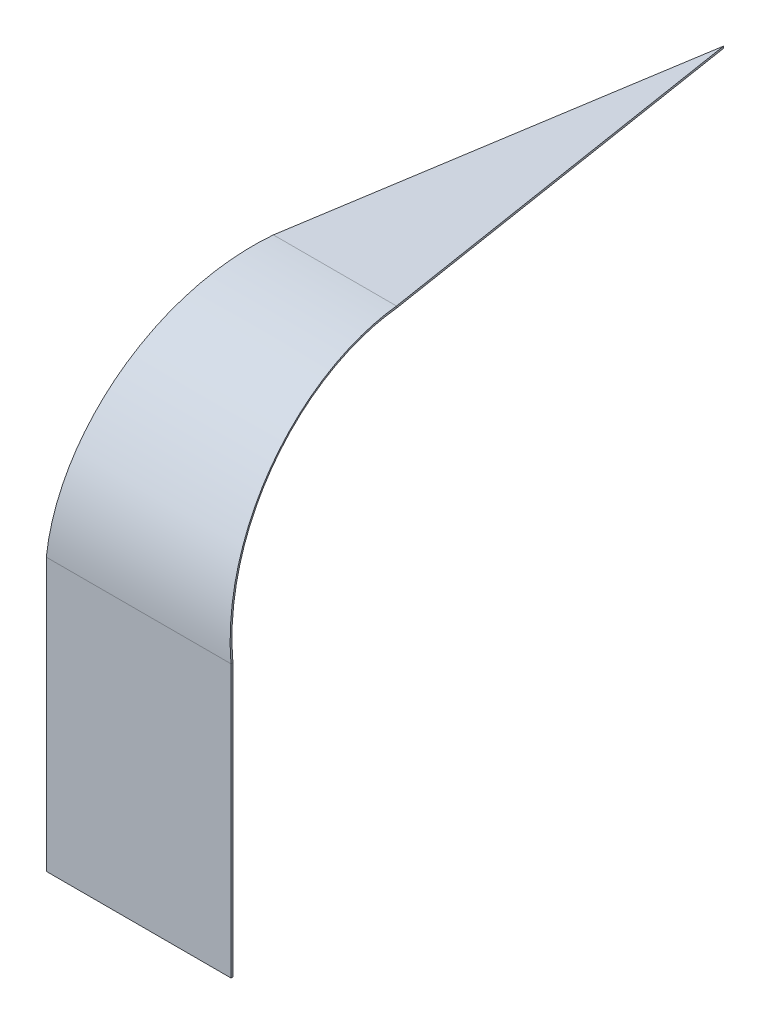
ISO-10303-21;
HEADER;
FILE_DESCRIPTION(('STEP AP214'),'2;1');
FILE_NAME('part.step','',(''),(''),'','','');
FILE_SCHEMA(('AUTOMOTIVE_DESIGN { 1 0 10303 214 1 1 1 1 }'));
ENDSEC;
DATA;
#1=APPLICATION_CONTEXT('core data for automotive mechanical design processes');
#2=APPLICATION_PROTOCOL_DEFINITION('international standard','automotive_design',2000,#1);
#3=PRODUCT_CONTEXT('',#1,'mechanical');
#4=PRODUCT('Part','Part','',(#3));
#5=PRODUCT_RELATED_PRODUCT_CATEGORY('part','',(#4));
#6=PRODUCT_DEFINITION_FORMATION('','',#4);
#7=PRODUCT_DEFINITION_CONTEXT('part definition',#1,'design');
#8=PRODUCT_DEFINITION('design','',#6,#7);
#9=PRODUCT_DEFINITION_SHAPE('','',#8);
#10=(LENGTH_UNIT() NAMED_UNIT(*) SI_UNIT(.MILLI.,.METRE.));
#11=(NAMED_UNIT(*) PLANE_ANGLE_UNIT() SI_UNIT($,.RADIAN.));
#12=(NAMED_UNIT(*) SI_UNIT($,.STERADIAN.) SOLID_ANGLE_UNIT());
#13=UNCERTAINTY_MEASURE_WITH_UNIT(LENGTH_MEASURE(1.E-05),#10,'distance_accuracy_value','');
#14=(GEOMETRIC_REPRESENTATION_CONTEXT(3) GLOBAL_UNCERTAINTY_ASSIGNED_CONTEXT((#13)) GLOBAL_UNIT_ASSIGNED_CONTEXT((#10,
#11,#12)) REPRESENTATION_CONTEXT('',''));
#15=CARTESIAN_POINT('',(0.,0.,0.));
#16=DIRECTION('',(0.,0.,1.));
#17=DIRECTION('',(1.,0.,0.));
#18=AXIS2_PLACEMENT_3D('',#15,#16,#17);
#19=CARTESIAN_POINT('',(0.,-1.,0.));
#20=DIRECTION('',(0.987688340595139,0.,-0.156434465040231));
#21=DIRECTION('',(-0.156434465040231,0.,-0.987688340595138));
#22=AXIS2_PLACEMENT_3D('',#19,#20,#21);
#23=PLANE('',#22);
#24=DIRECTION('',(-0.156434465040231,0.,-0.987688340595138));
#25=VECTOR('',#24,1.);
#26=CARTESIAN_POINT('',(0.,0.,0.));
#27=LINE('',#26,#25);
#28=CARTESIAN_POINT('',(31.6768880649073,0.,200.));
#29=VERTEX_POINT('',#28);
#30=CARTESIAN_POINT('',(0.,0.,0.));
#31=VERTEX_POINT('',#30);
#32=EDGE_CURVE('E287',#29,#31,#27,.T.);
#33=ORIENTED_EDGE('',*,*,#32,.F.);
#34=CARTESIAN_POINT('',(31.6768880649073,-1.,200.));
#35=CARTESIAN_POINT('',(31.6768880649073,-0.916666666666677,200.));
#36=CARTESIAN_POINT('',(31.6768880649073,-0.750000000000001,200.));
#37=CARTESIAN_POINT('',(31.6768880649073,-0.5,200.));
#38=CARTESIAN_POINT('',(31.6768880649073,-0.25,200.));
#39=CARTESIAN_POINT('',(31.6768880649073,-0.0833333333333242,200.));
#40=CARTESIAN_POINT('',(31.6768880649073,0.,200.));
#41=B_SPLINE_CURVE_WITH_KNOTS('',3,(#34,#35,#36,#37,#38,#39,#40),.UNSPECIFIED.,.F.,.F.,(4,1,1,1,
4),(0.5,0.501622235647171,0.503244471294342,0.504866706941513,0.506488942588684),.UNSPECIFIED.);
#42=CARTESIAN_POINT('',(31.6768880649073,-1.,200.));
#43=VERTEX_POINT('',#42);
#44=EDGE_CURVE('E13',#43,#29,#41,.T.);
#45=ORIENTED_EDGE('',*,*,#44,.F.);
#46=DIRECTION('',(-0.156434465040231,0.,-0.987688340595138));
#47=VECTOR('',#46,1.);
#48=CARTESIAN_POINT('',(0.,-1.,0.));
#49=LINE('',#48,#47);
#50=CARTESIAN_POINT('',(0.,-1.,0.));
#51=VERTEX_POINT('',#50);
#52=EDGE_CURVE('E173',#43,#51,#49,.T.);
#53=ORIENTED_EDGE('',*,*,#52,.T.);
#54=DIRECTION('',(0.,1.,0.));
#55=VECTOR('',#54,1.);
#56=CARTESIAN_POINT('',(0.,-1.,0.));
#57=LINE('',#56,#55);
#58=EDGE_CURVE('E142',#51,#31,#57,.T.);
#59=ORIENTED_EDGE('',*,*,#58,.T.);
#60=EDGE_LOOP('',(#33,#45,#53,#59));
#61=FACE_BOUND('',#60,.T.);
#62=ADVANCED_FACE('F114',(#61),#23,.T.);
#63=CARTESIAN_POINT('',(0.,-1.,0.));
#64=DIRECTION('',(-0.987688340595139,0.,-0.156434465040231));
#65=DIRECTION('',(-0.156434465040231,0.,0.987688340595138));
#66=AXIS2_PLACEMENT_3D('',#63,#64,#65);
#67=PLANE('',#66);
#68=DIRECTION('',(-0.156434465040231,0.,0.987688340595138));
#69=VECTOR('',#68,1.);
#70=CARTESIAN_POINT('',(0.,0.,0.));
#71=LINE('',#70,#69);
#72=CARTESIAN_POINT('',(-31.6768880649074,0.,200.));
#73=VERTEX_POINT('',#72);
#74=EDGE_CURVE('E167',#31,#73,#71,.T.);
#75=ORIENTED_EDGE('',*,*,#74,.F.);
#76=ORIENTED_EDGE('',*,*,#58,.F.);
#77=DIRECTION('',(-0.156434465040231,0.,0.987688340595138));
#78=VECTOR('',#77,1.);
#79=CARTESIAN_POINT('',(0.,-1.,0.));
#80=LINE('',#79,#78);
#81=CARTESIAN_POINT('',(-31.6768880649074,-1.,200.));
#82=VERTEX_POINT('',#81);
#83=EDGE_CURVE('E164',#51,#82,#80,.T.);
#84=ORIENTED_EDGE('',*,*,#83,.T.);
#85=CARTESIAN_POINT('',(-31.6768880649074,0.,200.));
#86=CARTESIAN_POINT('',(-31.6768880649074,-0.0833333333333242,200.));
#87=CARTESIAN_POINT('',(-31.6768880649074,-0.25,200.));
#88=CARTESIAN_POINT('',(-31.6768880649074,-0.5,200.));
#89=CARTESIAN_POINT('',(-31.6768880649073,-0.750000000000001,200.));
#90=CARTESIAN_POINT('',(-31.6768880649074,-0.916666666666677,200.));
#91=CARTESIAN_POINT('',(-31.6768880649074,-1.,200.));
#92=B_SPLINE_CURVE_WITH_KNOTS('',3,(#85,#86,#87,#88,#89,#90,#91),.UNSPECIFIED.,.F.,.F.,(4,1,1,1,
4),(0.,0.00162223564717101,0.00324447129434205,0.00486670694151303,0.00648894258868404),.UNSPECIFIED.);
#93=EDGE_CURVE('E125',#82,#73,#92,.F.);
#94=ORIENTED_EDGE('',*,*,#93,.T.);
#95=EDGE_LOOP('',(#75,#76,#84,#94));
#96=FACE_BOUND('',#95,.T.);
#97=ADVANCED_FACE('F163',(#96),#67,.T.);
#98=CARTESIAN_POINT('',(31.6768880649073,-1.,200.));
#99=DIRECTION('',(0.,1.,0.));
#100=DIRECTION('',(0.,0.,1.));
#101=AXIS2_PLACEMENT_3D('',#98,#99,#100);
#102=PLANE('',#101);
#103=ORIENTED_EDGE('',*,*,#52,.F.);
#104=CARTESIAN_POINT('',(-31.6768880649074,-1.,200.));
#105=CARTESIAN_POINT('',(-29.0235880245352,-1.,200.));
#106=CARTESIAN_POINT('',(-23.7306679637548,-1.,200.));
#107=CARTESIAN_POINT('',(-15.8165640692455,-1.,200.));
#108=CARTESIAN_POINT('',(-7.91248559223973,-1.,200.));
#109=CARTESIAN_POINT('',(-2.63974067207556,-1.,200.));
#110=CARTESIAN_POINT('',(2.63974067207562,-1.,200.));
#111=CARTESIAN_POINT('',(7.91248559223973,-1.,200.000000000001));
#112=CARTESIAN_POINT('',(15.8165640692454,-1.,200.));
#113=CARTESIAN_POINT('',(23.7306679637548,-1.,200.));
#114=CARTESIAN_POINT('',(29.0235880245351,-1.,200.));
#115=CARTESIAN_POINT('',(31.6768880649073,-1.,200.));
#116=B_SPLINE_CURVE_WITH_KNOTS('',3,(#104,#105,#106,#107,#108,#109,#110,#111,#112,#113,#114,
#115),.UNSPECIFIED.,.F.,.F.,(4,1,1,1,2,1,1,1,4),(0.506488942588684,0.568177824765099,
0.629866706941513,0.691555589117927,0.753244471294342,0.814933353470756,0.876622235647171,
0.938311117823586,1.),.UNSPECIFIED.);
#117=EDGE_CURVE('E169',#82,#43,#116,.T.);
#118=ORIENTED_EDGE('',*,*,#117,.F.);
#119=ORIENTED_EDGE('',*,*,#83,.F.);
#120=EDGE_LOOP('',(#103,#118,#119));
#121=FACE_BOUND('',#120,.T.);
#122=ADVANCED_FACE('F172',(#121),#102,.F.);
#123=CARTESIAN_POINT('',(31.6768880649073,0.,200.));
#124=DIRECTION('',(0.,1.,0.));
#125=DIRECTION('',(0.,0.,1.));
#126=AXIS2_PLACEMENT_3D('',#123,#124,#125);
#127=PLANE('',#126);
#128=ORIENTED_EDGE('',*,*,#32,.T.);
#129=ORIENTED_EDGE('',*,*,#74,.T.);
#130=CARTESIAN_POINT('',(31.6768880649073,0.,200.));
#131=CARTESIAN_POINT('',(26.3974067207561,0.,200.));
#132=CARTESIAN_POINT('',(15.8384440324536,0.,200.));
#133=CARTESIAN_POINT('',(-1.11022302462516E-13,0.,200.));
#134=CARTESIAN_POINT('',(-15.8384440324537,0.,200.));
#135=CARTESIAN_POINT('',(-26.3974067207561,0.,200.));
#136=CARTESIAN_POINT('',(-31.6768880649074,0.,200.));
#137=B_SPLINE_CURVE_WITH_KNOTS('',3,(#130,#131,#132,#133,#134,#135,#136),.UNSPECIFIED.,.F.,.F.,
(4,1,1,1,4),(0.00648894258868404,0.129866706941513,0.253244471294342,0.376622235647171,0.5),.UNSPECIFIED.);
#138=EDGE_CURVE('E178',#73,#29,#137,.F.);
#139=ORIENTED_EDGE('',*,*,#138,.T.);
#140=EDGE_LOOP('',(#128,#129,#139));
#141=FACE_BOUND('',#140,.T.);
#142=ADVANCED_FACE('F199',(#141),#127,.T.);
#143=CARTESIAN_POINT('',(47.5,-101.,300.));
#144=CARTESIAN_POINT('',(46.6209382258282,-92.1597005333333,300.));
#145=CARTESIAN_POINT('',(44.8628146774845,-74.7134879842578,297.652066259216));
#146=CARTESIAN_POINT('',(42.225629354969,-50.5506001395895,287.660743524164));
#147=CARTESIAN_POINT('',(39.5884440324537,-29.4615186681614,271.538481331839));
#148=CARTESIAN_POINT('',(36.9512587099382,-13.3392564758364,250.449399860411));
#149=CARTESIAN_POINT('',(34.3140733874228,-3.34793374078451,226.286512015742));
#150=CARTESIAN_POINT('',(32.5559498390791,-1.,208.840299466667));
#151=CARTESIAN_POINT('',(31.6768880649073,-1.,200.));
#152=CARTESIAN_POINT('',(43.5618939079376,-101.,300.));
#153=CARTESIAN_POINT('',(42.7542102477486,-92.1597005333333,300.));
#154=CARTESIAN_POINT('',(41.1388429273705,-74.7134879842578,297.652066259216));
#155=CARTESIAN_POINT('',(38.7157919468035,-50.5506001395895,287.660743524164));
#156=CARTESIAN_POINT('',(36.2927409662364,-29.4615186681614,271.538481331839));
#157=CARTESIAN_POINT('',(33.8696899856692,-13.3392564758364,250.449399860411));
#158=CARTESIAN_POINT('',(31.4466390051021,-3.34793374078451,226.286512015742));
#159=CARTESIAN_POINT('',(29.831271684724,-1.,208.840299466667));
#160=CARTESIAN_POINT('',(29.0235880245351,-1.,200.));
#161=CARTESIAN_POINT('',(35.6656340259621,-101.,300.));
#162=CARTESIAN_POINT('',(35.0025803558396,-92.1597005333334,300.));
#163=CARTESIAN_POINT('',(33.6764730155943,-74.7134879842578,297.652066259216));
#164=CARTESIAN_POINT('',(31.6873120052264,-50.5506001395896,287.660743524164));
#165=CARTESIAN_POINT('',(29.6981509948585,-29.4615186681614,271.538481331839));
#166=CARTESIAN_POINT('',(27.7089899844906,-13.3392564758364,250.449399860411));
#167=CARTESIAN_POINT('',(25.7198289741227,-3.34793374078454,226.286512015743));
#168=CARTESIAN_POINT('',(24.3937216338774,-1.,208.840299466667));
#169=CARTESIAN_POINT('',(23.7306679637548,-1.,200.));
#170=CARTESIAN_POINT('',(23.7831011692025,-101.,300.));
#171=CARTESIAN_POINT('',(23.3405157747603,-92.1597005333333,300.));
#172=CARTESIAN_POINT('',(22.4553449858763,-74.7134879842577,297.652066259216));
#173=CARTESIAN_POINT('',(21.1275888025502,-50.5506001395895,287.660743524164));
#174=CARTESIAN_POINT('',(19.799832619224,-29.4615186681613,271.538481331839));
#175=CARTESIAN_POINT('',(18.4720764358977,-13.3392564758363,250.44939986041));
#176=CARTESIAN_POINT('',(17.1443202525717,-3.34793374078451,226.286512015742));
#177=CARTESIAN_POINT('',(16.2591494636876,-1.,208.840299466666));
#178=CARTESIAN_POINT('',(15.8165640692454,-1.,200.));
#179=CARTESIAN_POINT('',(11.8851785824544,-101.,300.));
#180=CARTESIAN_POINT('',(11.6644734163314,-92.1597005333334,300.));
#181=CARTESIAN_POINT('',(11.2230630840852,-74.7134879842578,297.652066259216));
#182=CARTESIAN_POINT('',(10.5609475857161,-50.5506001395896,287.660743524164));
#183=CARTESIAN_POINT('',(9.89883208734699,-29.4615186681614,271.538481331839));
#184=CARTESIAN_POINT('',(9.2367165889779,-13.3392564758364,250.449399860411));
#185=CARTESIAN_POINT('',(8.57460109060876,-3.34793374078454,226.286512015743));
#186=CARTESIAN_POINT('',(8.13319075836277,-1.,208.840299466667));
#187=CARTESIAN_POINT('',(7.91248559223973,-1.,200.000000000001));
#188=CARTESIAN_POINT('',(3.95833333333329,-101.,300.));
#189=CARTESIAN_POINT('',(3.88507818548561,-92.1597005333333,300.));
#190=CARTESIAN_POINT('',(3.73856788979043,-74.7134879842578,297.652066259216));
#191=CARTESIAN_POINT('',(3.51880244624742,-50.5506001395895,287.660743524164));
#192=CARTESIAN_POINT('',(3.29903700270445,-29.4615186681614,271.538481331839));
#193=CARTESIAN_POINT('',(3.07927155916149,-13.3392564758364,250.449399860411));
#194=CARTESIAN_POINT('',(2.85950611561858,-3.34793374078451,226.286512015742));
#195=CARTESIAN_POINT('',(2.71299581992318,-1.,208.840299466667));
#196=CARTESIAN_POINT('',(2.63974067207562,-1.,200.));
#197=CARTESIAN_POINT('',(-3.95833333333334,-101.,300.));
#198=CARTESIAN_POINT('',(-3.88507818548567,-92.1597005333333,300.));
#199=CARTESIAN_POINT('',(-3.73856788979032,-74.7134879842578,297.652066259216));
#200=CARTESIAN_POINT('',(-3.51880244624747,-50.5506001395895,287.660743524164));
#201=CARTESIAN_POINT('',(-3.29903700270445,-29.4615186681614,271.538481331839));
#202=CARTESIAN_POINT('',(-3.0792715591616,-13.3392564758364,250.449399860411));
#203=CARTESIAN_POINT('',(-2.85950611561853,-3.34793374078451,226.286512015742));
#204=CARTESIAN_POINT('',(-2.71299581992324,-1.,208.840299466667));
#205=CARTESIAN_POINT('',(-2.63974067207556,-1.,200.));
#206=CARTESIAN_POINT('',(-11.8851785824544,-101.,300.));
#207=CARTESIAN_POINT('',(-11.6644734163314,-92.1597005333333,300.));
#208=CARTESIAN_POINT('',(-11.2230630840853,-74.7134879842578,297.652066259215));
#209=CARTESIAN_POINT('',(-10.5609475857162,-50.5506001395895,287.660743524164));
#210=CARTESIAN_POINT('',(-9.89883208734704,-29.4615186681614,271.538481331839));
#211=CARTESIAN_POINT('',(-9.23671658897796,-13.3392564758364,250.44939986041));
#212=CARTESIAN_POINT('',(-8.57460109060887,-3.34793374078451,226.286512015742));
#213=CARTESIAN_POINT('',(-8.13319075836277,-1.,208.840299466667));
#214=CARTESIAN_POINT('',(-7.91248559223973,-1.,200.));
#215=CARTESIAN_POINT('',(-23.7831011692026,-101.,300.000000000001));
#216=CARTESIAN_POINT('',(-23.3405157747604,-92.1597005333333,300.000000000001));
#217=CARTESIAN_POINT('',(-22.4553449858764,-74.7134879842578,297.652066259216));
#218=CARTESIAN_POINT('',(-21.1275888025502,-50.5506001395895,287.660743524164));
#219=CARTESIAN_POINT('',(-19.7998326192241,-29.4615186681614,271.538481331839));
#220=CARTESIAN_POINT('',(-18.4720764358979,-13.3392564758364,250.449399860411));
#221=CARTESIAN_POINT('',(-17.1443202525717,-3.34793374078451,226.286512015742));
#222=CARTESIAN_POINT('',(-16.2591494636875,-1.,208.840299466667));
#223=CARTESIAN_POINT('',(-15.8165640692455,-1.,200.));
#224=CARTESIAN_POINT('',(-35.6656340259623,-101.,300.));
#225=CARTESIAN_POINT('',(-35.0025803558395,-92.1597005333333,300.));
#226=CARTESIAN_POINT('',(-33.6764730155943,-74.7134879842578,297.652066259215));
#227=CARTESIAN_POINT('',(-31.6873120052265,-50.5506001395895,287.660743524163));
#228=CARTESIAN_POINT('',(-29.6981509948584,-29.4615186681614,271.538481331839));
#229=CARTESIAN_POINT('',(-27.7089899844906,-13.3392564758364,250.44939986041));
#230=CARTESIAN_POINT('',(-25.7198289741228,-3.34793374078451,226.286512015742));
#231=CARTESIAN_POINT('',(-24.3937216338775,-1.,208.840299466667));
#232=CARTESIAN_POINT('',(-23.7306679637548,-1.,200.));
#233=CARTESIAN_POINT('',(-43.5618939079376,-101.,300.));
#234=CARTESIAN_POINT('',(-42.7542102477487,-92.1597005333333,300.));
#235=CARTESIAN_POINT('',(-41.1388429273706,-74.7134879842578,297.652066259216));
#236=CARTESIAN_POINT('',(-38.7157919468035,-50.5506001395895,287.660743524164));
#237=CARTESIAN_POINT('',(-36.2927409662364,-29.4615186681614,271.538481331839));
#238=CARTESIAN_POINT('',(-33.8696899856692,-13.3392564758364,250.449399860411));
#239=CARTESIAN_POINT('',(-31.4466390051022,-3.34793374078451,226.286512015742));
#240=CARTESIAN_POINT('',(-29.8312716847242,-1.,208.840299466667));
#241=CARTESIAN_POINT('',(-29.0235880245352,-1.,200.));
#242=CARTESIAN_POINT('',(-47.4999999999999,-101.,300.));
#243=CARTESIAN_POINT('',(-46.6209382258283,-92.1597005333333,300.));
#244=CARTESIAN_POINT('',(-44.8628146774845,-74.7134879842578,297.652066259216));
#245=CARTESIAN_POINT('',(-42.2256293549692,-50.5506001395895,287.660743524164));
#246=CARTESIAN_POINT('',(-39.5884440324537,-29.4615186681614,271.538481331839));
#247=CARTESIAN_POINT('',(-36.9512587099383,-13.3392564758364,250.449399860411));
#248=CARTESIAN_POINT('',(-34.3140733874228,-3.34793374078451,226.286512015742));
#249=CARTESIAN_POINT('',(-32.5559498390792,-1.,208.840299466667));
#250=CARTESIAN_POINT('',(-31.6768880649074,-1.,200.));
#251=B_SPLINE_SURFACE_WITH_KNOTS('',3,3,((#143,#144,#145,#146,#147,#148,#149,#150,#151),(#152,
#153,#154,#155,#156,#157,#158,#159,#160),(#161,#162,#163,#164,#165,#166,#167,#168,#169),(#170,
#171,#172,#173,#174,#175,#176,#177,#178),(#179,#180,#181,#182,#183,#184,#185,#186,#187),(#188,
#189,#190,#191,#192,#193,#194,#195,#196),(#197,#198,#199,#200,#201,#202,#203,#204,#205),(#206,
#207,#208,#209,#210,#211,#212,#213,#214),(#215,#216,#217,#218,#219,#220,#221,#222,#223),(#224,
#225,#226,#227,#228,#229,#230,#231,#232),(#233,#234,#235,#236,#237,#238,#239,#240,#241),(#242,
#243,#244,#245,#246,#247,#248,#249,#250)),.UNSPECIFIED.,.F.,.F.,.F.,(4,1,1,1,2,1,1,1,4),(4,1,1,
1,1,1,4),(0.506488942588684,0.568177824765098,0.629866706941513,0.691555589117928,
0.753244471294342,0.814933353470757,0.876622235647171,0.938311117823585,1.),(0.,
0.166666666666667,0.333333333333333,0.5,0.666666666666667,0.833333333333333,1.),.UNSPECIFIED.);
#252=DIRECTION('',(1.,0.,0.));
#253=VECTOR('',#252,1.);
#254=CARTESIAN_POINT('',(-47.4999999999999,-101.,300.));
#255=LINE('',#254,#253);
#256=CARTESIAN_POINT('',(-47.4999999999999,-101.,300.));
#257=VERTEX_POINT('',#256);
#258=CARTESIAN_POINT('',(47.5,-101.,300.));
#259=VERTEX_POINT('',#258);
#260=EDGE_CURVE('E235',#257,#259,#255,.T.);
#261=CARTESIAN_POINT('',(-47.4999999999999,-101.,300.));
#262=CARTESIAN_POINT('',(-46.6209382258283,-92.1597005333333,300.));
#263=CARTESIAN_POINT('',(-44.8628146774845,-74.7134879842578,297.652066259216));
#264=CARTESIAN_POINT('',(-42.2256293549692,-50.5506001395895,287.660743524164));
#265=CARTESIAN_POINT('',(-39.5884440324537,-29.4615186681614,271.538481331839));
#266=CARTESIAN_POINT('',(-36.9512587099383,-13.3392564758364,250.449399860411));
#267=CARTESIAN_POINT('',(-34.3140733874228,-3.34793374078451,226.286512015742));
#268=CARTESIAN_POINT('',(-32.5559498390792,-1.,208.840299466667));
#269=CARTESIAN_POINT('',(-31.6768880649074,-1.,200.));
#270=B_SPLINE_CURVE_WITH_KNOTS('',3,(#261,#262,#263,#264,#265,#266,#267,#268,#269),
.UNSPECIFIED.,.F.,.F.,(4,1,1,1,1,1,4),(0.,0.166666666666667,0.333333333333333,0.5,
0.666666666666667,0.833333333333333,1.),.UNSPECIFIED.);
#271=EDGE_CURVE('E367',#257,#82,#270,.T.);
#272=CARTESIAN_POINT('',(47.5,-101.,300.));
#273=CARTESIAN_POINT('',(46.6209382258282,-92.1597005333333,300.));
#274=CARTESIAN_POINT('',(44.8628146774845,-74.7134879842578,297.652066259216));
#275=CARTESIAN_POINT('',(42.225629354969,-50.5506001395895,287.660743524164));
#276=CARTESIAN_POINT('',(39.5884440324537,-29.4615186681614,271.538481331839));
#277=CARTESIAN_POINT('',(36.9512587099382,-13.3392564758364,250.449399860411));
#278=CARTESIAN_POINT('',(34.3140733874228,-3.34793374078451,226.286512015742));
#279=CARTESIAN_POINT('',(32.5559498390791,-1.,208.840299466667));
#280=CARTESIAN_POINT('',(31.6768880649073,-1.,200.));
#281=B_SPLINE_CURVE_WITH_KNOTS('',3,(#272,#273,#274,#275,#276,#277,#278,#279,#280),
.UNSPECIFIED.,.F.,.F.,(4,1,1,1,1,1,4),(0.,0.166666666666667,0.333333333333333,0.5,
0.666666666666667,0.833333333333333,1.),.UNSPECIFIED.);
#282=EDGE_CURVE('E360',#259,#43,#281,.T.);
#283=ORIENTED_EDGE('',*,*,#260,.F.);
#284=ORIENTED_EDGE('',*,*,#271,.T.);
#285=ORIENTED_EDGE('',*,*,#117,.T.);
#286=ORIENTED_EDGE('',*,*,#282,.F.);
#287=EDGE_LOOP('',(#283,#284,#285,#286));
#288=FACE_BOUND('',#287,.T.);
#289=ADVANCED_FACE('F200',(#288),#251,.T.);
#290=CARTESIAN_POINT('',(47.4999999999999,-101.,301.));
#291=CARTESIAN_POINT('',(46.6209382258282,-92.1041449777778,300.944444444445));
#292=CARTESIAN_POINT('',(44.8628146774845,-74.5468213175911,298.485399592549));
#293=CARTESIAN_POINT('',(42.2256293549692,-50.2172668062562,288.327410190831));
#294=CARTESIAN_POINT('',(39.5884440324537,-28.9615186681614,272.038481331839));
#295=CARTESIAN_POINT('',(36.9512587099383,-12.6725898091697,250.782733193744));
#296=CARTESIAN_POINT('',(34.3140733874228,-2.51460040745119,226.453178682409));
#297=CARTESIAN_POINT('',(32.5559498390792,-0.0555555555555587,208.895855022222));
#298=CARTESIAN_POINT('',(31.6768880649073,0.,200.));
#299=CARTESIAN_POINT('',(47.5,-101.,300.916666666667));
#300=CARTESIAN_POINT('',(46.6209382258282,-92.1087746074074,300.865740740741));
#301=CARTESIAN_POINT('',(44.8628146774846,-74.56071020648,298.415955148105));
#302=CARTESIAN_POINT('',(42.225629354969,-50.245044584034,288.271854635275));
#303=CARTESIAN_POINT('',(39.5884440324537,-29.003185334828,271.996814665172));
#304=CARTESIAN_POINT('',(36.9512587099383,-12.7281453647253,250.754955415966));
#305=CARTESIAN_POINT('',(34.3140733874228,-2.58404485189565,226.43928979352));
#306=CARTESIAN_POINT('',(32.5559498390792,-0.134259259259251,208.891225392593));
#307=CARTESIAN_POINT('',(31.6768880649073,-0.0833333333333242,200.));
#308=CARTESIAN_POINT('',(47.4999999999999,-101.,300.750000000001));
#309=CARTESIAN_POINT('',(46.6209382258281,-92.1180338666666,300.708333333334));
#310=CARTESIAN_POINT('',(44.8628146774845,-74.5884879842578,298.277066259216));
#311=CARTESIAN_POINT('',(42.2256293549691,-50.3006001395895,288.160743524164));
#312=CARTESIAN_POINT('',(39.5884440324537,-29.0865186681613,271.913481331839));
#313=CARTESIAN_POINT('',(36.9512587099382,-12.8392564758364,250.699399860411));
#314=CARTESIAN_POINT('',(34.3140733874228,-2.7229337407845,226.411512015742));
#315=CARTESIAN_POINT('',(32.5559498390792,-0.291666666666662,208.881966133334));
#316=CARTESIAN_POINT('',(31.6768880649073,-0.25,200.));
#317=CARTESIAN_POINT('',(47.5,-101.,300.5));
#318=CARTESIAN_POINT('',(46.6209382258282,-92.1319227555555,300.472222222222));
#319=CARTESIAN_POINT('',(44.8628146774846,-74.6301546509245,298.068732925882));
#320=CARTESIAN_POINT('',(42.2256293549691,-50.3839334729229,287.994076857497));
#321=CARTESIAN_POINT('',(39.5884440324537,-29.2115186681614,271.788481331839));
#322=CARTESIAN_POINT('',(36.9512587099383,-13.005923142503,250.616066527077));
#323=CARTESIAN_POINT('',(34.3140733874228,-2.93126707411787,226.369845349075));
#324=CARTESIAN_POINT('',(32.5559498390791,-0.527777777777766,208.868077244444));
#325=CARTESIAN_POINT('',(31.6768880649073,-0.5,200.));
#326=CARTESIAN_POINT('',(47.5,-101.,300.250000000001));
#327=CARTESIAN_POINT('',(46.6209382258282,-92.1458116444444,300.236111111112));
#328=CARTESIAN_POINT('',(44.8628146774846,-74.6718213175911,297.860399592549));
#329=CARTESIAN_POINT('',(42.2256293549692,-50.4672668062562,287.827410190831));
#330=CARTESIAN_POINT('',(39.5884440324537,-29.3365186681614,271.663481331839));
#331=CARTESIAN_POINT('',(36.9512587099383,-13.1725898091697,250.532733193744));
#332=CARTESIAN_POINT('',(34.3140733874228,-3.13960040745118,226.328178682409));
#333=CARTESIAN_POINT('',(32.5559498390792,-0.763888888888897,208.854188355556));
#334=CARTESIAN_POINT('',(31.6768880649073,-0.750000000000001,200.));
#335=CARTESIAN_POINT('',(47.5,-101.,300.083333333334));
#336=CARTESIAN_POINT('',(46.6209382258281,-92.1550709037037,300.078703703704));
#337=CARTESIAN_POINT('',(44.8628146774846,-74.6995990953689,297.72151070366));
#338=CARTESIAN_POINT('',(42.225629354969,-50.5228223618118,287.71629907972));
#339=CARTESIAN_POINT('',(39.5884440324537,-29.4198520014947,271.580147998506));
#340=CARTESIAN_POINT('',(36.9512587099383,-13.2837009202808,250.477177638188));
#341=CARTESIAN_POINT('',(34.3140733874228,-3.27848929634009,226.300400904631));
#342=CARTESIAN_POINT('',(32.5559498390791,-0.921296296296309,208.844929096296));
#343=CARTESIAN_POINT('',(31.6768880649073,-0.916666666666677,200.));
#344=CARTESIAN_POINT('',(47.5,-101.,300.));
#345=CARTESIAN_POINT('',(46.6209382258282,-92.1597005333333,300.));
#346=CARTESIAN_POINT('',(44.8628146774845,-74.7134879842578,297.652066259216));
#347=CARTESIAN_POINT('',(42.225629354969,-50.5506001395895,287.660743524164));
#348=CARTESIAN_POINT('',(39.5884440324537,-29.4615186681614,271.538481331839));
#349=CARTESIAN_POINT('',(36.9512587099382,-13.3392564758364,250.449399860411));
#350=CARTESIAN_POINT('',(34.3140733874228,-3.34793374078451,226.286512015742));
#351=CARTESIAN_POINT('',(32.5559498390791,-1.,208.840299466667));
#352=CARTESIAN_POINT('',(31.6768880649073,-1.,200.));
#353=B_SPLINE_SURFACE_WITH_KNOTS('',3,3,((#290,#291,#292,#293,#294,#295,#296,#297,#298),(#299,
#300,#301,#302,#303,#304,#305,#306,#307),(#308,#309,#310,#311,#312,#313,#314,#315,#316),(#317,
#318,#319,#320,#321,#322,#323,#324,#325),(#326,#327,#328,#329,#330,#331,#332,#333,#334),(#335,
#336,#337,#338,#339,#340,#341,#342,#343),(#344,#345,#346,#347,#348,#349,#350,#351,#352)),
.UNSPECIFIED.,.F.,.F.,.F.,(4,1,1,1,4),(4,1,1,1,1,1,4),(0.5,0.501622235647171,0.503244471294342,
0.504866706941513,0.506488942588684),(0.,0.166666666666667,0.333333333333333,0.5,
0.666666666666667,0.833333333333333,1.),.UNSPECIFIED.);
#354=DIRECTION('',(0.,0.,1.));
#355=VECTOR('',#354,1.);
#356=CARTESIAN_POINT('',(47.4999999999999,-101.,301.));
#357=LINE('',#356,#355);
#358=CARTESIAN_POINT('',(47.4999999999999,-101.,301.));
#359=VERTEX_POINT('',#358);
#360=EDGE_CURVE('E118',#259,#359,#357,.T.);
#361=CARTESIAN_POINT('',(47.4999999999999,-101.,301.));
#362=CARTESIAN_POINT('',(46.6209382258282,-92.1041449777778,300.944444444445));
#363=CARTESIAN_POINT('',(44.8628146774845,-74.5468213175911,298.485399592549));
#364=CARTESIAN_POINT('',(42.2256293549692,-50.2172668062562,288.327410190831));
#365=CARTESIAN_POINT('',(39.5884440324537,-28.9615186681614,272.038481331839));
#366=CARTESIAN_POINT('',(36.9512587099383,-12.6725898091697,250.782733193744));
#367=CARTESIAN_POINT('',(34.3140733874228,-2.51460040745119,226.453178682409));
#368=CARTESIAN_POINT('',(32.5559498390792,-0.0555555555555587,208.895855022222));
#369=CARTESIAN_POINT('',(31.6768880649073,0.,200.));
#370=B_SPLINE_CURVE_WITH_KNOTS('',3,(#361,#362,#363,#364,#365,#366,#367,#368,#369),
.UNSPECIFIED.,.F.,.F.,(4,1,1,1,1,1,4),(0.,0.166666666666667,0.333333333333333,0.5,
0.666666666666667,0.833333333333333,1.),.UNSPECIFIED.);
#371=EDGE_CURVE('E151',#359,#29,#370,.T.);
#372=ORIENTED_EDGE('',*,*,#360,.F.);
#373=ORIENTED_EDGE('',*,*,#282,.T.);
#374=ORIENTED_EDGE('',*,*,#44,.T.);
#375=ORIENTED_EDGE('',*,*,#371,.F.);
#376=EDGE_LOOP('',(#372,#373,#374,#375));
#377=FACE_BOUND('',#376,.T.);
#378=ADVANCED_FACE('F334',(#377),#353,.T.);
#379=CARTESIAN_POINT('',(-47.5000000000001,-101.,301.));
#380=CARTESIAN_POINT('',(-46.6209382258282,-92.1041449777778,300.944444444445));
#381=CARTESIAN_POINT('',(-44.8628146774846,-74.5468213175911,298.485399592549));
#382=CARTESIAN_POINT('',(-42.2256293549692,-50.2172668062562,288.327410190831));
#383=CARTESIAN_POINT('',(-39.5884440324538,-28.9615186681614,272.038481331839));
#384=CARTESIAN_POINT('',(-36.9512587099383,-12.6725898091697,250.782733193744));
#385=CARTESIAN_POINT('',(-34.3140733874229,-2.51460040745119,226.453178682409));
#386=CARTESIAN_POINT('',(-32.5559498390793,-0.0555555555555587,208.895855022222));
#387=CARTESIAN_POINT('',(-31.6768880649074,0.,200.));
#388=CARTESIAN_POINT('',(-39.5833333333334,-101.,301.));
#389=CARTESIAN_POINT('',(-38.8507818548569,-92.1041449777778,300.944444444445));
#390=CARTESIAN_POINT('',(-37.3856788979037,-74.5468213175911,298.485399592549));
#391=CARTESIAN_POINT('',(-35.1880244624743,-50.2172668062562,288.327410190831));
#392=CARTESIAN_POINT('',(-32.9903700270447,-28.9615186681614,272.038481331839));
#393=CARTESIAN_POINT('',(-30.7927155916152,-12.6725898091697,250.782733193744));
#394=CARTESIAN_POINT('',(-28.5950611561857,-2.51460040745119,226.453178682409));
#395=CARTESIAN_POINT('',(-27.1299581992326,-0.0555555555555587,208.895855022222));
#396=CARTESIAN_POINT('',(-26.3974067207561,0.,200.));
#397=CARTESIAN_POINT('',(-23.75,-101.,301.));
#398=CARTESIAN_POINT('',(-23.3104691129141,-92.1041449777777,300.944444444445));
#399=CARTESIAN_POINT('',(-22.4314073387423,-74.5468213175911,298.485399592549));
#400=CARTESIAN_POINT('',(-21.1128146774846,-50.2172668062562,288.327410190831));
#401=CARTESIAN_POINT('',(-19.7942220162268,-28.9615186681614,272.038481331839));
#402=CARTESIAN_POINT('',(-18.4756293549691,-12.6725898091697,250.782733193744));
#403=CARTESIAN_POINT('',(-17.1570366937114,-2.51460040745119,226.453178682409));
#404=CARTESIAN_POINT('',(-16.2779749195396,-0.0555555555555587,208.895855022222));
#405=CARTESIAN_POINT('',(-15.8384440324537,0.,200.));
#406=CARTESIAN_POINT('',(0.,-101.,301.));
#407=CARTESIAN_POINT('',(0.,-92.1041449777778,300.944444444444));
#408=CARTESIAN_POINT('',(0.,-74.5468213175911,298.485399592549));
#409=CARTESIAN_POINT('',(0.,-50.2172668062562,288.32741019083));
#410=CARTESIAN_POINT('',(0.,-28.9615186681614,272.038481331839));
#411=CARTESIAN_POINT('',(0.,-12.6725898091697,250.782733193744));
#412=CARTESIAN_POINT('',(0.,-2.51460040745119,226.453178682409));
#413=CARTESIAN_POINT('',(0.,-0.0555555555555587,208.895855022222));
#414=CARTESIAN_POINT('',(-1.11022302462516E-13,0.,200.));
#415=CARTESIAN_POINT('',(23.75,-101.,301.));
#416=CARTESIAN_POINT('',(23.3104691129141,-92.1041449777778,300.944444444445));
#417=CARTESIAN_POINT('',(22.4314073387422,-74.5468213175911,298.485399592549));
#418=CARTESIAN_POINT('',(21.1128146774845,-50.2172668062562,288.327410190831));
#419=CARTESIAN_POINT('',(19.7942220162268,-28.9615186681614,272.038481331839));
#420=CARTESIAN_POINT('',(18.4756293549691,-12.6725898091697,250.782733193744));
#421=CARTESIAN_POINT('',(17.1570366937114,-2.51460040745119,226.453178682409));
#422=CARTESIAN_POINT('',(16.2779749195395,-0.0555555555555587,208.895855022222));
#423=CARTESIAN_POINT('',(15.8384440324536,0.,200.));
#424=CARTESIAN_POINT('',(39.5833333333334,-101.,301.));
#425=CARTESIAN_POINT('',(38.8507818548569,-92.1041449777778,300.944444444445));
#426=CARTESIAN_POINT('',(37.3856788979038,-74.5468213175911,298.485399592549));
#427=CARTESIAN_POINT('',(35.1880244624743,-50.2172668062562,288.327410190831));
#428=CARTESIAN_POINT('',(32.9903700270447,-28.9615186681614,272.038481331839));
#429=CARTESIAN_POINT('',(30.7927155916152,-12.6725898091697,250.782733193744));
#430=CARTESIAN_POINT('',(28.5950611561857,-2.51460040745119,226.453178682409));
#431=CARTESIAN_POINT('',(27.1299581992326,-0.0555555555555587,208.895855022222));
#432=CARTESIAN_POINT('',(26.3974067207561,0.,200.));
#433=CARTESIAN_POINT('',(47.4999999999999,-101.,301.));
#434=CARTESIAN_POINT('',(46.6209382258282,-92.1041449777778,300.944444444445));
#435=CARTESIAN_POINT('',(44.8628146774845,-74.5468213175911,298.485399592549));
#436=CARTESIAN_POINT('',(42.2256293549692,-50.2172668062562,288.327410190831));
#437=CARTESIAN_POINT('',(39.5884440324537,-28.9615186681614,272.038481331839));
#438=CARTESIAN_POINT('',(36.9512587099383,-12.6725898091697,250.782733193744));
#439=CARTESIAN_POINT('',(34.3140733874228,-2.51460040745119,226.453178682409));
#440=CARTESIAN_POINT('',(32.5559498390792,-0.0555555555555587,208.895855022222));
#441=CARTESIAN_POINT('',(31.6768880649073,0.,200.));
#442=B_SPLINE_SURFACE_WITH_KNOTS('',3,3,((#379,#380,#381,#382,#383,#384,#385,#386,#387),(#388,
#389,#390,#391,#392,#393,#394,#395,#396),(#397,#398,#399,#400,#401,#402,#403,#404,#405),(#406,
#407,#408,#409,#410,#411,#412,#413,#414),(#415,#416,#417,#418,#419,#420,#421,#422,#423),(#424,
#425,#426,#427,#428,#429,#430,#431,#432),(#433,#434,#435,#436,#437,#438,#439,#440,#441)),
.UNSPECIFIED.,.F.,.F.,.F.,(4,1,1,1,4),(4,1,1,1,1,1,4),(0.00648894258868404,0.129866706941513,
0.253244471294342,0.376622235647171,0.5),(0.,0.166666666666667,0.333333333333333,0.5,
0.666666666666667,0.833333333333333,1.),.UNSPECIFIED.);
#443=DIRECTION('',(-1.,0.,0.));
#444=VECTOR('',#443,1.);
#445=CARTESIAN_POINT('',(-47.5000000000001,-101.,301.));
#446=LINE('',#445,#444);
#447=CARTESIAN_POINT('',(-47.5000000000001,-101.,301.));
#448=VERTEX_POINT('',#447);
#449=EDGE_CURVE('E279',#359,#448,#446,.T.);
#450=CARTESIAN_POINT('',(-47.5000000000001,-101.,301.));
#451=CARTESIAN_POINT('',(-46.6209382258282,-92.1041449777778,300.944444444445));
#452=CARTESIAN_POINT('',(-44.8628146774846,-74.5468213175911,298.485399592549));
#453=CARTESIAN_POINT('',(-42.2256293549692,-50.2172668062562,288.327410190831));
#454=CARTESIAN_POINT('',(-39.5884440324538,-28.9615186681614,272.038481331839));
#455=CARTESIAN_POINT('',(-36.9512587099383,-12.6725898091697,250.782733193744));
#456=CARTESIAN_POINT('',(-34.3140733874229,-2.51460040745119,226.453178682409));
#457=CARTESIAN_POINT('',(-32.5559498390793,-0.0555555555555587,208.895855022222));
#458=CARTESIAN_POINT('',(-31.6768880649074,0.,200.));
#459=B_SPLINE_CURVE_WITH_KNOTS('',3,(#450,#451,#452,#453,#454,#455,#456,#457,#458),
.UNSPECIFIED.,.F.,.F.,(4,1,1,1,1,1,4),(0.,0.166666666666667,0.333333333333333,0.5,
0.666666666666667,0.833333333333333,1.),.UNSPECIFIED.);
#460=EDGE_CURVE('E411',#448,#73,#459,.T.);
#461=ORIENTED_EDGE('',*,*,#449,.F.);
#462=ORIENTED_EDGE('',*,*,#371,.T.);
#463=ORIENTED_EDGE('',*,*,#138,.F.);
#464=ORIENTED_EDGE('',*,*,#460,.F.);
#465=EDGE_LOOP('',(#461,#462,#463,#464));
#466=FACE_BOUND('',#465,.T.);
#467=ADVANCED_FACE('F344',(#466),#442,.T.);
#468=CARTESIAN_POINT('',(-47.4999999999999,-101.,300.));
#469=CARTESIAN_POINT('',(-46.6209382258283,-92.1597005333333,300.));
#470=CARTESIAN_POINT('',(-44.8628146774845,-74.7134879842578,297.652066259216));
#471=CARTESIAN_POINT('',(-42.2256293549692,-50.5506001395895,287.660743524164));
#472=CARTESIAN_POINT('',(-39.5884440324537,-29.4615186681614,271.538481331839));
#473=CARTESIAN_POINT('',(-36.9512587099383,-13.3392564758364,250.449399860411));
#474=CARTESIAN_POINT('',(-34.3140733874228,-3.34793374078451,226.286512015742));
#475=CARTESIAN_POINT('',(-32.5559498390792,-1.,208.840299466667));
#476=CARTESIAN_POINT('',(-31.6768880649074,-1.,200.));
#477=CARTESIAN_POINT('',(-47.5000000000002,-101.,300.083333333334));
#478=CARTESIAN_POINT('',(-46.6209382258282,-92.1550709037037,300.078703703704));
#479=CARTESIAN_POINT('',(-44.8628146774846,-74.6995990953689,297.72151070366));
#480=CARTESIAN_POINT('',(-42.2256293549692,-50.5228223618118,287.71629907972));
#481=CARTESIAN_POINT('',(-39.5884440324538,-29.4198520014947,271.580147998505));
#482=CARTESIAN_POINT('',(-36.9512587099383,-13.2837009202808,250.477177638188));
#483=CARTESIAN_POINT('',(-34.3140733874229,-3.27848929634009,226.300400904631));
#484=CARTESIAN_POINT('',(-32.5559498390792,-0.921296296296309,208.844929096296));
#485=CARTESIAN_POINT('',(-31.6768880649074,-0.916666666666677,200.));
#486=CARTESIAN_POINT('',(-47.5,-101.,300.25));
#487=CARTESIAN_POINT('',(-46.6209382258282,-92.1458116444444,300.236111111111));
#488=CARTESIAN_POINT('',(-44.8628146774845,-74.6718213175911,297.860399592549));
#489=CARTESIAN_POINT('',(-42.225629354969,-50.4672668062562,287.827410190831));
#490=CARTESIAN_POINT('',(-39.5884440324536,-29.3365186681614,271.663481331839));
#491=CARTESIAN_POINT('',(-36.9512587099382,-13.1725898091697,250.532733193744));
#492=CARTESIAN_POINT('',(-34.3140733874227,-3.13960040745118,226.328178682409));
#493=CARTESIAN_POINT('',(-32.5559498390791,-0.763888888888897,208.854188355556));
#494=CARTESIAN_POINT('',(-31.6768880649073,-0.750000000000001,200.));
#495=CARTESIAN_POINT('',(-47.5000000000002,-101.,300.5));
#496=CARTESIAN_POINT('',(-46.6209382258283,-92.1319227555555,300.472222222222));
#497=CARTESIAN_POINT('',(-44.8628146774846,-74.6301546509244,298.068732925882));
#498=CARTESIAN_POINT('',(-42.2256293549692,-50.3839334729229,287.994076857497));
#499=CARTESIAN_POINT('',(-39.5884440324539,-29.2115186681614,271.788481331839));
#500=CARTESIAN_POINT('',(-36.9512587099384,-13.005923142503,250.616066527077));
#501=CARTESIAN_POINT('',(-34.3140733874228,-2.93126707411787,226.369845349076));
#502=CARTESIAN_POINT('',(-32.5559498390791,-0.527777777777766,208.868077244444));
#503=CARTESIAN_POINT('',(-31.6768880649074,-0.5,200.));
#504=CARTESIAN_POINT('',(-47.5,-101.,300.75));
#505=CARTESIAN_POINT('',(-46.6209382258282,-92.1180338666667,300.708333333334));
#506=CARTESIAN_POINT('',(-44.8628146774845,-74.5884879842578,298.277066259216));
#507=CARTESIAN_POINT('',(-42.225629354969,-50.3006001395895,288.160743524164));
#508=CARTESIAN_POINT('',(-39.5884440324537,-29.0865186681614,271.913481331839));
#509=CARTESIAN_POINT('',(-36.9512587099383,-12.8392564758364,250.699399860411));
#510=CARTESIAN_POINT('',(-34.3140733874227,-2.72293374078453,226.411512015742));
#511=CARTESIAN_POINT('',(-32.5559498390792,-0.291666666666662,208.881966133334));
#512=CARTESIAN_POINT('',(-31.6768880649074,-0.25,200.));
#513=CARTESIAN_POINT('',(-47.5,-101.,300.916666666667));
#514=CARTESIAN_POINT('',(-46.6209382258283,-92.1087746074074,300.865740740741));
#515=CARTESIAN_POINT('',(-44.8628146774845,-74.56071020648,298.415955148105));
#516=CARTESIAN_POINT('',(-42.2256293549692,-50.245044584034,288.271854635275));
#517=CARTESIAN_POINT('',(-39.5884440324537,-29.003185334828,271.996814665172));
#518=CARTESIAN_POINT('',(-36.9512587099383,-12.7281453647253,250.754955415966));
#519=CARTESIAN_POINT('',(-34.3140733874229,-2.58404485189565,226.43928979352));
#520=CARTESIAN_POINT('',(-32.5559498390792,-0.134259259259251,208.891225392593));
#521=CARTESIAN_POINT('',(-31.6768880649074,-0.0833333333333242,200.));
#522=CARTESIAN_POINT('',(-47.5000000000001,-101.,301.));
#523=CARTESIAN_POINT('',(-46.6209382258282,-92.1041449777778,300.944444444445));
#524=CARTESIAN_POINT('',(-44.8628146774846,-74.5468213175911,298.485399592549));
#525=CARTESIAN_POINT('',(-42.2256293549692,-50.2172668062562,288.327410190831));
#526=CARTESIAN_POINT('',(-39.5884440324538,-28.9615186681614,272.038481331839));
#527=CARTESIAN_POINT('',(-36.9512587099383,-12.6725898091697,250.782733193744));
#528=CARTESIAN_POINT('',(-34.3140733874229,-2.51460040745119,226.453178682409));
#529=CARTESIAN_POINT('',(-32.5559498390793,-0.0555555555555587,208.895855022222));
#530=CARTESIAN_POINT('',(-31.6768880649074,0.,200.));
#531=B_SPLINE_SURFACE_WITH_KNOTS('',3,3,((#468,#469,#470,#471,#472,#473,#474,#475,#476),(#477,
#478,#479,#480,#481,#482,#483,#484,#485),(#486,#487,#488,#489,#490,#491,#492,#493,#494),(#495,
#496,#497,#498,#499,#500,#501,#502,#503),(#504,#505,#506,#507,#508,#509,#510,#511,#512),(#513,
#514,#515,#516,#517,#518,#519,#520,#521),(#522,#523,#524,#525,#526,#527,#528,#529,#530)),
.UNSPECIFIED.,.F.,.F.,.F.,(4,1,1,1,4),(4,1,1,1,1,1,4),(0.,0.00162223564717101,
0.00324447129434199,0.00486670694151303,0.00648894258868404),(0.,0.166666666666667,
0.333333333333333,0.5,0.666666666666667,0.833333333333333,1.),.UNSPECIFIED.);
#532=DIRECTION('',(0.,0.,-1.));
#533=VECTOR('',#532,1.);
#534=CARTESIAN_POINT('',(-47.5000000000001,-101.,301.));
#535=LINE('',#534,#533);
#536=EDGE_CURVE('E271',#448,#257,#535,.T.);
#537=ORIENTED_EDGE('',*,*,#536,.F.);
#538=ORIENTED_EDGE('',*,*,#460,.T.);
#539=ORIENTED_EDGE('',*,*,#93,.F.);
#540=ORIENTED_EDGE('',*,*,#271,.F.);
#541=EDGE_LOOP('',(#537,#538,#539,#540));
#542=FACE_BOUND('',#541,.T.);
#543=ADVANCED_FACE('F208',(#542),#531,.T.);
#544=CARTESIAN_POINT('',(-47.5000000000001,-241.,301.));
#545=DIRECTION('',(1.,0.,0.));
#546=DIRECTION('',(0.,0.,-1.));
#547=AXIS2_PLACEMENT_3D('',#544,#545,#546);
#548=PLANE('',#547);
#549=ORIENTED_EDGE('',*,*,#536,.T.);
#550=DIRECTION('',(0.,1.,0.));
#551=VECTOR('',#550,1.);
#552=CARTESIAN_POINT('',(-47.4999999999999,-241.,300.));
#553=LINE('',#552,#551);
#554=CARTESIAN_POINT('',(-47.4999999999999,-241.,300.));
#555=VERTEX_POINT('',#554);
#556=EDGE_CURVE('E224',#555,#257,#553,.T.);
#557=ORIENTED_EDGE('',*,*,#556,.F.);
#558=DIRECTION('',(0.,0.,-1.));
#559=VECTOR('',#558,1.);
#560=CARTESIAN_POINT('',(-47.5000000000001,-241.,301.));
#561=LINE('',#560,#559);
#562=CARTESIAN_POINT('',(-47.5000000000001,-241.,301.));
#563=VERTEX_POINT('',#562);
#564=EDGE_CURVE('E433',#563,#555,#561,.T.);
#565=ORIENTED_EDGE('',*,*,#564,.F.);
#566=DIRECTION('',(0.,1.,0.));
#567=VECTOR('',#566,1.);
#568=CARTESIAN_POINT('',(-47.5000000000001,-241.,301.));
#569=LINE('',#568,#567);
#570=EDGE_CURVE('E280',#563,#448,#569,.T.);
#571=ORIENTED_EDGE('',*,*,#570,.T.);
#572=EDGE_LOOP('',(#549,#557,#565,#571));
#573=FACE_BOUND('',#572,.T.);
#574=ADVANCED_FACE('F253',(#573),#548,.F.);
#575=CARTESIAN_POINT('',(-47.4999999999999,-241.,300.));
#576=DIRECTION('',(0.,0.,1.));
#577=DIRECTION('',(1.,0.,0.));
#578=AXIS2_PLACEMENT_3D('',#575,#576,#577);
#579=PLANE('',#578);
#580=ORIENTED_EDGE('',*,*,#260,.T.);
#581=DIRECTION('',(0.,1.,0.));
#582=VECTOR('',#581,1.);
#583=CARTESIAN_POINT('',(47.5,-241.,300.));
#584=LINE('',#583,#582);
#585=CARTESIAN_POINT('',(47.5,-241.,300.));
#586=VERTEX_POINT('',#585);
#587=EDGE_CURVE('E216',#586,#259,#584,.T.);
#588=ORIENTED_EDGE('',*,*,#587,.F.);
#589=DIRECTION('',(1.,0.,0.));
#590=VECTOR('',#589,1.);
#591=CARTESIAN_POINT('',(-47.4999999999999,-241.,300.));
#592=LINE('',#591,#590);
#593=EDGE_CURVE('E427',#555,#586,#592,.T.);
#594=ORIENTED_EDGE('',*,*,#593,.F.);
#595=ORIENTED_EDGE('',*,*,#556,.T.);
#596=EDGE_LOOP('',(#580,#588,#594,#595));
#597=FACE_BOUND('',#596,.T.);
#598=ADVANCED_FACE('F242',(#597),#579,.F.);
#599=CARTESIAN_POINT('',(47.4999999999999,-241.,301.));
#600=DIRECTION('',(-1.,0.,0.));
#601=DIRECTION('',(0.,0.,1.));
#602=AXIS2_PLACEMENT_3D('',#599,#600,#601);
#603=PLANE('',#602);
#604=ORIENTED_EDGE('',*,*,#360,.T.);
#605=DIRECTION('',(0.,1.,0.));
#606=VECTOR('',#605,1.);
#607=CARTESIAN_POINT('',(47.4999999999999,-241.,301.));
#608=LINE('',#607,#606);
#609=CARTESIAN_POINT('',(47.4999999999999,-241.,301.));
#610=VERTEX_POINT('',#609);
#611=EDGE_CURVE('E225',#610,#359,#608,.T.);
#612=ORIENTED_EDGE('',*,*,#611,.F.);
#613=DIRECTION('',(0.,0.,1.));
#614=VECTOR('',#613,1.);
#615=CARTESIAN_POINT('',(47.4999999999999,-241.,301.));
#616=LINE('',#615,#614);
#617=EDGE_CURVE('E430',#586,#610,#616,.T.);
#618=ORIENTED_EDGE('',*,*,#617,.F.);
#619=ORIENTED_EDGE('',*,*,#587,.T.);
#620=EDGE_LOOP('',(#604,#612,#618,#619));
#621=FACE_BOUND('',#620,.T.);
#622=ADVANCED_FACE('F252',(#621),#603,.F.);
#623=CARTESIAN_POINT('',(-47.5000000000001,-241.,301.));
#624=DIRECTION('',(0.,0.,-1.));
#625=DIRECTION('',(-1.,0.,0.));
#626=AXIS2_PLACEMENT_3D('',#623,#624,#625);
#627=PLANE('',#626);
#628=ORIENTED_EDGE('',*,*,#449,.T.);
#629=ORIENTED_EDGE('',*,*,#570,.F.);
#630=DIRECTION('',(-1.,0.,0.));
#631=VECTOR('',#630,1.);
#632=CARTESIAN_POINT('',(-47.5000000000001,-241.,301.));
#633=LINE('',#632,#631);
#634=EDGE_CURVE('E438',#610,#563,#633,.T.);
#635=ORIENTED_EDGE('',*,*,#634,.F.);
#636=ORIENTED_EDGE('',*,*,#611,.T.);
#637=EDGE_LOOP('',(#628,#629,#635,#636));
#638=FACE_BOUND('',#637,.T.);
#639=ADVANCED_FACE('F467',(#638),#627,.F.);
#640=CARTESIAN_POINT('',(-47.4999999999999,-241.,300.));
#641=DIRECTION('',(0.,-1.,0.));
#642=DIRECTION('',(0.,0.,-1.));
#643=AXIS2_PLACEMENT_3D('',#640,#641,#642);
#644=PLANE('',#643);
#645=ORIENTED_EDGE('',*,*,#564,.T.);
#646=ORIENTED_EDGE('',*,*,#593,.T.);
#647=ORIENTED_EDGE('',*,*,#617,.T.);
#648=ORIENTED_EDGE('',*,*,#634,.T.);
#649=EDGE_LOOP('',(#645,#646,#647,#648));
#650=FACE_BOUND('',#649,.T.);
#651=ADVANCED_FACE('F428',(#650),#644,.T.);
#652=CLOSED_SHELL('',(#62,#97,#122,#142,#289,#378,#467,#543,#574,#598,#622,#639,#651));
#653=MANIFOLD_SOLID_BREP('B2',#652);
#654=ADVANCED_BREP_SHAPE_REPRESENTATION('',(#18,#653),#14);
#655=SHAPE_DEFINITION_REPRESENTATION(#9,#654);
ENDSEC;
END-ISO-10303-21;
